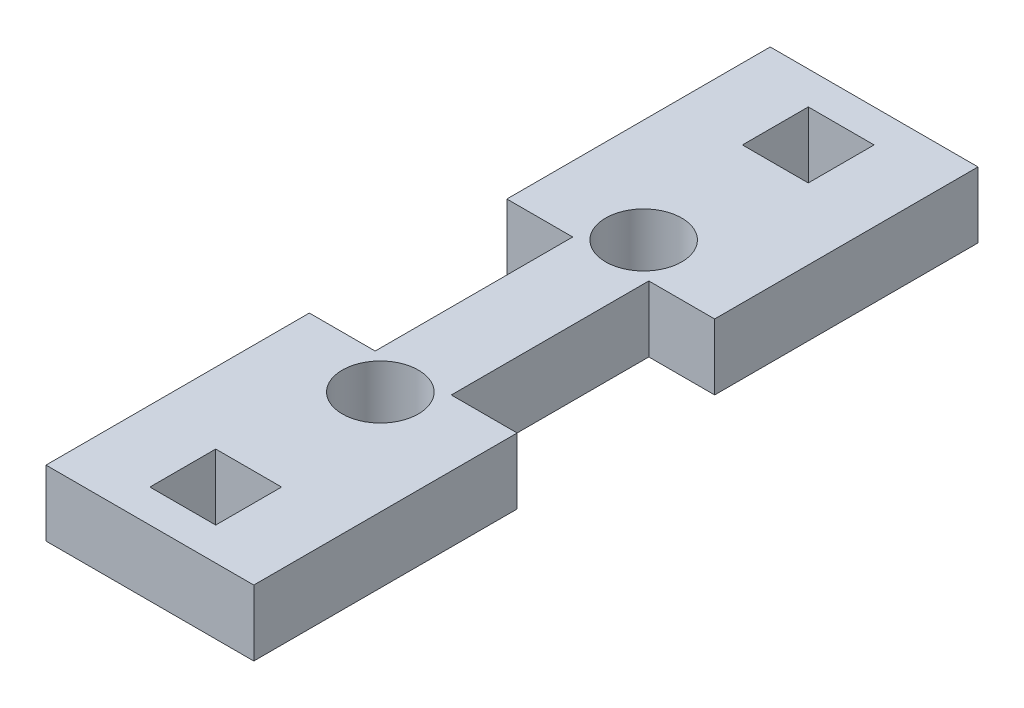
ISO-10303-21;
HEADER;
FILE_DESCRIPTION(('STEP AP214'),'2;1');
FILE_NAME('part.step','',(''),(''),'','','');
FILE_SCHEMA(('AUTOMOTIVE_DESIGN { 1 0 10303 214 1 1 1 1 }'));
ENDSEC;
DATA;
#1=APPLICATION_CONTEXT('core data for automotive mechanical design processes');
#2=APPLICATION_PROTOCOL_DEFINITION('international standard','automotive_design',2000,#1);
#3=PRODUCT_CONTEXT('',#1,'mechanical');
#4=PRODUCT('Part','Part','',(#3));
#5=PRODUCT_RELATED_PRODUCT_CATEGORY('part','',(#4));
#6=PRODUCT_DEFINITION_FORMATION('','',#4);
#7=PRODUCT_DEFINITION_CONTEXT('part definition',#1,'design');
#8=PRODUCT_DEFINITION('design','',#6,#7);
#9=PRODUCT_DEFINITION_SHAPE('','',#8);
#10=(LENGTH_UNIT() NAMED_UNIT(*) SI_UNIT(.MILLI.,.METRE.));
#11=(NAMED_UNIT(*) PLANE_ANGLE_UNIT() SI_UNIT($,.RADIAN.));
#12=(NAMED_UNIT(*) SI_UNIT($,.STERADIAN.) SOLID_ANGLE_UNIT());
#13=UNCERTAINTY_MEASURE_WITH_UNIT(LENGTH_MEASURE(1.E-05),#10,'distance_accuracy_value','');
#14=(GEOMETRIC_REPRESENTATION_CONTEXT(3) GLOBAL_UNCERTAINTY_ASSIGNED_CONTEXT((#13)) GLOBAL_UNIT_ASSIGNED_CONTEXT((#10,
#11,#12)) REPRESENTATION_CONTEXT('',''));
#15=CARTESIAN_POINT('',(0.,0.,0.));
#16=DIRECTION('',(0.,0.,1.));
#17=DIRECTION('',(1.,0.,0.));
#18=AXIS2_PLACEMENT_3D('',#15,#16,#17);
#19=CARTESIAN_POINT('',(0.,6.35,-44.45));
#20=DIRECTION('',(0.,0.,-1.));
#21=DIRECTION('',(-1.,0.,0.));
#22=AXIS2_PLACEMENT_3D('',#19,#20,#21);
#23=PLANE('',#22);
#24=DIRECTION('',(1.,0.,0.));
#25=VECTOR('',#24,1.);
#26=CARTESIAN_POINT('',(0.,0.,-44.45));
#27=LINE('',#26,#25);
#28=CARTESIAN_POINT('',(0.,0.,-44.45));
#29=VERTEX_POINT('',#28);
#30=CARTESIAN_POINT('',(6.35,0.,-44.45));
#31=VERTEX_POINT('',#30);
#32=EDGE_CURVE('E244',#29,#31,#27,.T.);
#33=ORIENTED_EDGE('',*,*,#32,.T.);
#34=DIRECTION('',(0.,-1.,0.));
#35=VECTOR('',#34,1.);
#36=CARTESIAN_POINT('',(6.35,6.35,-44.45));
#37=LINE('',#36,#35);
#38=CARTESIAN_POINT('',(6.35,6.35,-44.45));
#39=VERTEX_POINT('',#38);
#40=EDGE_CURVE('E11',#39,#31,#37,.T.);
#41=ORIENTED_EDGE('',*,*,#40,.F.);
#42=DIRECTION('',(1.,0.,0.));
#43=VECTOR('',#42,1.);
#44=CARTESIAN_POINT('',(0.,6.35,-44.45));
#45=LINE('',#44,#43);
#46=CARTESIAN_POINT('',(0.,6.35,-44.45));
#47=VERTEX_POINT('',#46);
#48=EDGE_CURVE('E512',#47,#39,#45,.T.);
#49=ORIENTED_EDGE('',*,*,#48,.F.);
#50=DIRECTION('',(0.,-1.,0.));
#51=VECTOR('',#50,1.);
#52=CARTESIAN_POINT('',(0.,6.35,-44.45));
#53=LINE('',#52,#51);
#54=EDGE_CURVE('E54',#47,#29,#53,.T.);
#55=ORIENTED_EDGE('',*,*,#54,.T.);
#56=EDGE_LOOP('',(#33,#41,#49,#55));
#57=FACE_BOUND('',#56,.T.);
#58=ADVANCED_FACE('F35',(#57),#23,.F.);
#59=CARTESIAN_POINT('',(6.35000000000002,6.35,0.));
#60=DIRECTION('',(1.,0.,0.));
#61=DIRECTION('',(0.,0.,-1.));
#62=AXIS2_PLACEMENT_3D('',#59,#60,#61);
#63=PLANE('',#62);
#64=DIRECTION('',(0.,0.,1.));
#65=VECTOR('',#64,1.);
#66=CARTESIAN_POINT('',(6.35000000000002,0.,0.));
#67=LINE('',#66,#65);
#68=CARTESIAN_POINT('',(6.35,0.,-25.4));
#69=VERTEX_POINT('',#68);
#70=EDGE_CURVE('E246',#31,#69,#67,.T.);
#71=ORIENTED_EDGE('',*,*,#70,.T.);
#72=DIRECTION('',(0.,-1.,0.));
#73=VECTOR('',#72,1.);
#74=CARTESIAN_POINT('',(6.35,6.35,-25.4));
#75=LINE('',#74,#73);
#76=CARTESIAN_POINT('',(6.35,6.35,-25.4));
#77=VERTEX_POINT('',#76);
#78=EDGE_CURVE('E45',#77,#69,#75,.T.);
#79=ORIENTED_EDGE('',*,*,#78,.F.);
#80=DIRECTION('',(0.,0.,1.));
#81=VECTOR('',#80,1.);
#82=CARTESIAN_POINT('',(6.35000000000002,6.35,0.));
#83=LINE('',#82,#81);
#84=EDGE_CURVE('E473',#39,#77,#83,.T.);
#85=ORIENTED_EDGE('',*,*,#84,.F.);
#86=ORIENTED_EDGE('',*,*,#40,.T.);
#87=EDGE_LOOP('',(#71,#79,#85,#86));
#88=FACE_BOUND('',#87,.T.);
#89=ADVANCED_FACE('F332',(#88),#63,.F.);
#90=CARTESIAN_POINT('',(0.,6.35,-25.4));
#91=DIRECTION('',(0.,0.,-1.));
#92=DIRECTION('',(-1.,0.,0.));
#93=AXIS2_PLACEMENT_3D('',#90,#91,#92);
#94=PLANE('',#93);
#95=DIRECTION('',(1.,0.,0.));
#96=VECTOR('',#95,1.);
#97=CARTESIAN_POINT('',(0.,0.,-25.4));
#98=LINE('',#97,#96);
#99=CARTESIAN_POINT('',(0.,0.,-25.4));
#100=VERTEX_POINT('',#99);
#101=EDGE_CURVE('E249',#100,#69,#98,.T.);
#102=ORIENTED_EDGE('',*,*,#101,.F.);
#103=DIRECTION('',(0.,-1.,0.));
#104=VECTOR('',#103,1.);
#105=CARTESIAN_POINT('',(0.,6.35,-25.4));
#106=LINE('',#105,#104);
#107=CARTESIAN_POINT('',(0.,6.35,-25.4));
#108=VERTEX_POINT('',#107);
#109=EDGE_CURVE('E286',#108,#100,#106,.T.);
#110=ORIENTED_EDGE('',*,*,#109,.F.);
#111=DIRECTION('',(1.,0.,0.));
#112=VECTOR('',#111,1.);
#113=CARTESIAN_POINT('',(0.,6.35,-25.4));
#114=LINE('',#113,#112);
#115=EDGE_CURVE('E471',#108,#77,#114,.T.);
#116=ORIENTED_EDGE('',*,*,#115,.T.);
#117=ORIENTED_EDGE('',*,*,#78,.T.);
#118=EDGE_LOOP('',(#102,#110,#116,#117));
#119=FACE_BOUND('',#118,.T.);
#120=ADVANCED_FACE('F337',(#119),#94,.T.);
#121=CARTESIAN_POINT('',(0.,6.35,0.));
#122=DIRECTION('',(-1.,0.,0.));
#123=DIRECTION('',(0.,0.,1.));
#124=AXIS2_PLACEMENT_3D('',#121,#122,#123);
#125=PLANE('',#124);
#126=DIRECTION('',(0.,0.,-1.));
#127=VECTOR('',#126,1.);
#128=CARTESIAN_POINT('',(0.,0.,0.));
#129=LINE('',#128,#127);
#130=CARTESIAN_POINT('',(0.,0.,0.));
#131=VERTEX_POINT('',#130);
#132=EDGE_CURVE('E252',#131,#100,#129,.T.);
#133=ORIENTED_EDGE('',*,*,#132,.F.);
#134=DIRECTION('',(0.,-1.,0.));
#135=VECTOR('',#134,1.);
#136=CARTESIAN_POINT('',(0.,6.35,0.));
#137=LINE('',#136,#135);
#138=CARTESIAN_POINT('',(0.,6.35,0.));
#139=VERTEX_POINT('',#138);
#140=EDGE_CURVE('E284',#139,#131,#137,.T.);
#141=ORIENTED_EDGE('',*,*,#140,.F.);
#142=DIRECTION('',(0.,0.,-1.));
#143=VECTOR('',#142,1.);
#144=CARTESIAN_POINT('',(0.,6.35,0.));
#145=LINE('',#144,#143);
#146=EDGE_CURVE('E210',#139,#108,#145,.T.);
#147=ORIENTED_EDGE('',*,*,#146,.T.);
#148=ORIENTED_EDGE('',*,*,#109,.T.);
#149=EDGE_LOOP('',(#133,#141,#147,#148));
#150=FACE_BOUND('',#149,.T.);
#151=ADVANCED_FACE('F410',(#150),#125,.T.);
#152=CARTESIAN_POINT('',(0.,6.35,0.));
#153=DIRECTION('',(0.,0.,-1.));
#154=DIRECTION('',(-1.,0.,0.));
#155=AXIS2_PLACEMENT_3D('',#152,#153,#154);
#156=PLANE('',#155);
#157=DIRECTION('',(1.,0.,0.));
#158=VECTOR('',#157,1.);
#159=CARTESIAN_POINT('',(0.,0.,0.));
#160=LINE('',#159,#158);
#161=CARTESIAN_POINT('',(20.0405999999999,0.,0.));
#162=VERTEX_POINT('',#161);
#163=EDGE_CURVE('E255',#131,#162,#160,.T.);
#164=ORIENTED_EDGE('',*,*,#163,.T.);
#165=DIRECTION('',(0.,-1.,0.));
#166=VECTOR('',#165,1.);
#167=CARTESIAN_POINT('',(20.0405999999999,6.35,0.));
#168=LINE('',#167,#166);
#169=CARTESIAN_POINT('',(20.0405999999999,6.35,0.));
#170=VERTEX_POINT('',#169);
#171=EDGE_CURVE('E281',#170,#162,#168,.T.);
#172=ORIENTED_EDGE('',*,*,#171,.F.);
#173=DIRECTION('',(1.,0.,0.));
#174=VECTOR('',#173,1.);
#175=CARTESIAN_POINT('',(0.,6.35,0.));
#176=LINE('',#175,#174);
#177=EDGE_CURVE('E470',#139,#170,#176,.T.);
#178=ORIENTED_EDGE('',*,*,#177,.F.);
#179=ORIENTED_EDGE('',*,*,#140,.T.);
#180=EDGE_LOOP('',(#164,#172,#178,#179));
#181=FACE_BOUND('',#180,.T.);
#182=ADVANCED_FACE('F450',(#181),#156,.F.);
#183=CARTESIAN_POINT('',(20.0405999999999,6.35,0.));
#184=DIRECTION('',(-1.,0.,0.));
#185=DIRECTION('',(0.,0.,1.));
#186=AXIS2_PLACEMENT_3D('',#183,#184,#185);
#187=PLANE('',#186);
#188=DIRECTION('',(0.,0.,-1.));
#189=VECTOR('',#188,1.);
#190=CARTESIAN_POINT('',(20.0405999999999,0.,0.));
#191=LINE('',#190,#189);
#192=CARTESIAN_POINT('',(20.0405999999999,0.,-25.4));
#193=VERTEX_POINT('',#192);
#194=EDGE_CURVE('E258',#162,#193,#191,.T.);
#195=ORIENTED_EDGE('',*,*,#194,.T.);
#196=DIRECTION('',(0.,-1.,0.));
#197=VECTOR('',#196,1.);
#198=CARTESIAN_POINT('',(20.0405999999999,6.35,-25.4));
#199=LINE('',#198,#197);
#200=CARTESIAN_POINT('',(20.0405999999999,6.35,-25.4));
#201=VERTEX_POINT('',#200);
#202=EDGE_CURVE('E279',#201,#193,#199,.T.);
#203=ORIENTED_EDGE('',*,*,#202,.F.);
#204=DIRECTION('',(0.,0.,-1.));
#205=VECTOR('',#204,1.);
#206=CARTESIAN_POINT('',(20.0405999999999,6.35,0.));
#207=LINE('',#206,#205);
#208=EDGE_CURVE('E195',#170,#201,#207,.T.);
#209=ORIENTED_EDGE('',*,*,#208,.F.);
#210=ORIENTED_EDGE('',*,*,#171,.T.);
#211=EDGE_LOOP('',(#195,#203,#209,#210));
#212=FACE_BOUND('',#211,.T.);
#213=ADVANCED_FACE('F438',(#212),#187,.F.);
#214=CARTESIAN_POINT('',(0.,6.35,-25.4));
#215=DIRECTION('',(0.,0.,-1.));
#216=DIRECTION('',(-1.,0.,0.));
#217=AXIS2_PLACEMENT_3D('',#214,#215,#216);
#218=PLANE('',#217);
#219=DIRECTION('',(1.,0.,0.));
#220=VECTOR('',#219,1.);
#221=CARTESIAN_POINT('',(0.,0.,-25.4));
#222=LINE('',#221,#220);
#223=CARTESIAN_POINT('',(13.6905999999999,0.,-25.4));
#224=VERTEX_POINT('',#223);
#225=EDGE_CURVE('E261',#224,#193,#222,.T.);
#226=ORIENTED_EDGE('',*,*,#225,.F.);
#227=DIRECTION('',(0.,-1.,0.));
#228=VECTOR('',#227,1.);
#229=CARTESIAN_POINT('',(13.6905999999999,6.35,-25.4));
#230=LINE('',#229,#228);
#231=CARTESIAN_POINT('',(13.6905999999999,6.35,-25.4));
#232=VERTEX_POINT('',#231);
#233=EDGE_CURVE('E277',#232,#224,#230,.T.);
#234=ORIENTED_EDGE('',*,*,#233,.F.);
#235=DIRECTION('',(1.,0.,0.));
#236=VECTOR('',#235,1.);
#237=CARTESIAN_POINT('',(0.,6.35,-25.4));
#238=LINE('',#237,#236);
#239=EDGE_CURVE('E477',#232,#201,#238,.T.);
#240=ORIENTED_EDGE('',*,*,#239,.T.);
#241=ORIENTED_EDGE('',*,*,#202,.T.);
#242=EDGE_LOOP('',(#226,#234,#240,#241));
#243=FACE_BOUND('',#242,.T.);
#244=ADVANCED_FACE('F445',(#243),#218,.T.);
#245=CARTESIAN_POINT('',(13.6905999999999,6.35,0.));
#246=DIRECTION('',(1.,0.,0.));
#247=DIRECTION('',(0.,0.,-1.));
#248=AXIS2_PLACEMENT_3D('',#245,#246,#247);
#249=PLANE('',#248);
#250=DIRECTION('',(0.,0.,1.));
#251=VECTOR('',#250,1.);
#252=CARTESIAN_POINT('',(13.6905999999999,0.,0.));
#253=LINE('',#252,#251);
#254=CARTESIAN_POINT('',(13.6905999999999,0.,-44.45));
#255=VERTEX_POINT('',#254);
#256=EDGE_CURVE('E264',#255,#224,#253,.T.);
#257=ORIENTED_EDGE('',*,*,#256,.F.);
#258=DIRECTION('',(0.,-1.,0.));
#259=VECTOR('',#258,1.);
#260=CARTESIAN_POINT('',(13.6905999999999,6.35,-44.45));
#261=LINE('',#260,#259);
#262=CARTESIAN_POINT('',(13.6905999999999,6.35,-44.45));
#263=VERTEX_POINT('',#262);
#264=EDGE_CURVE('E275',#263,#255,#261,.T.);
#265=ORIENTED_EDGE('',*,*,#264,.F.);
#266=DIRECTION('',(0.,0.,1.));
#267=VECTOR('',#266,1.);
#268=CARTESIAN_POINT('',(13.6905999999999,6.35,0.));
#269=LINE('',#268,#267);
#270=EDGE_CURVE('E479',#263,#232,#269,.T.);
#271=ORIENTED_EDGE('',*,*,#270,.T.);
#272=ORIENTED_EDGE('',*,*,#233,.T.);
#273=EDGE_LOOP('',(#257,#265,#271,#272));
#274=FACE_BOUND('',#273,.T.);
#275=ADVANCED_FACE('F441',(#274),#249,.T.);
#276=CARTESIAN_POINT('',(0.,6.35,-44.45));
#277=DIRECTION('',(0.,0.,-1.));
#278=DIRECTION('',(-1.,0.,0.));
#279=AXIS2_PLACEMENT_3D('',#276,#277,#278);
#280=PLANE('',#279);
#281=DIRECTION('',(1.,0.,0.));
#282=VECTOR('',#281,1.);
#283=CARTESIAN_POINT('',(0.,0.,-44.45));
#284=LINE('',#283,#282);
#285=CARTESIAN_POINT('',(20.0405999999999,0.,-44.45));
#286=VERTEX_POINT('',#285);
#287=EDGE_CURVE('E267',#255,#286,#284,.T.);
#288=ORIENTED_EDGE('',*,*,#287,.T.);
#289=DIRECTION('',(0.,-1.,0.));
#290=VECTOR('',#289,1.);
#291=CARTESIAN_POINT('',(20.0405999999999,6.35,-44.45));
#292=LINE('',#291,#290);
#293=CARTESIAN_POINT('',(20.0405999999999,6.35,-44.45));
#294=VERTEX_POINT('',#293);
#295=EDGE_CURVE('E203',#294,#286,#292,.T.);
#296=ORIENTED_EDGE('',*,*,#295,.F.);
#297=DIRECTION('',(1.,0.,0.));
#298=VECTOR('',#297,1.);
#299=CARTESIAN_POINT('',(0.,6.35,-44.45));
#300=LINE('',#299,#298);
#301=EDGE_CURVE('E190',#263,#294,#300,.T.);
#302=ORIENTED_EDGE('',*,*,#301,.F.);
#303=ORIENTED_EDGE('',*,*,#264,.T.);
#304=EDGE_LOOP('',(#288,#296,#302,#303));
#305=FACE_BOUND('',#304,.T.);
#306=ADVANCED_FACE('F437',(#305),#280,.F.);
#307=CARTESIAN_POINT('',(20.0405999999999,0.,-69.85));
#308=VERTEX_POINT('',#307);
#309=EDGE_CURVE('E200',#286,#308,#191,.T.);
#310=ORIENTED_EDGE('',*,*,#309,.T.);
#311=DIRECTION('',(0.,-1.,0.));
#312=VECTOR('',#311,1.);
#313=CARTESIAN_POINT('',(20.0405999999999,6.35,-69.85));
#314=LINE('',#313,#312);
#315=CARTESIAN_POINT('',(20.0405999999999,6.35,-69.85));
#316=VERTEX_POINT('',#315);
#317=EDGE_CURVE('E197',#316,#308,#314,.T.);
#318=ORIENTED_EDGE('',*,*,#317,.F.);
#319=EDGE_CURVE('E181',#294,#316,#207,.T.);
#320=ORIENTED_EDGE('',*,*,#319,.F.);
#321=ORIENTED_EDGE('',*,*,#295,.T.);
#322=EDGE_LOOP('',(#310,#318,#320,#321));
#323=FACE_BOUND('',#322,.T.);
#324=ADVANCED_FACE('F198',(#323),#187,.F.);
#325=CARTESIAN_POINT('',(0.,6.35,-69.85));
#326=DIRECTION('',(0.,0.,-1.));
#327=DIRECTION('',(-1.,0.,0.));
#328=AXIS2_PLACEMENT_3D('',#325,#326,#327);
#329=PLANE('',#328);
#330=DIRECTION('',(1.,0.,0.));
#331=VECTOR('',#330,1.);
#332=CARTESIAN_POINT('',(0.,0.,-69.85));
#333=LINE('',#332,#331);
#334=CARTESIAN_POINT('',(0.,0.,-69.85));
#335=VERTEX_POINT('',#334);
#336=EDGE_CURVE('E269',#335,#308,#333,.T.);
#337=ORIENTED_EDGE('',*,*,#336,.F.);
#338=DIRECTION('',(0.,-1.,0.));
#339=VECTOR('',#338,1.);
#340=CARTESIAN_POINT('',(0.,6.35,-69.85));
#341=LINE('',#340,#339);
#342=CARTESIAN_POINT('',(0.,6.35,-69.85));
#343=VERTEX_POINT('',#342);
#344=EDGE_CURVE('E116',#343,#335,#341,.T.);
#345=ORIENTED_EDGE('',*,*,#344,.F.);
#346=DIRECTION('',(1.,0.,0.));
#347=VECTOR('',#346,1.);
#348=CARTESIAN_POINT('',(0.,6.35,-69.85));
#349=LINE('',#348,#347);
#350=EDGE_CURVE('E187',#343,#316,#349,.T.);
#351=ORIENTED_EDGE('',*,*,#350,.T.);
#352=ORIENTED_EDGE('',*,*,#317,.T.);
#353=EDGE_LOOP('',(#337,#345,#351,#352));
#354=FACE_BOUND('',#353,.T.);
#355=ADVANCED_FACE('F205',(#354),#329,.T.);
#356=CARTESIAN_POINT('',(-1.45716771982052E-13,6.35,-66.675));
#357=DIRECTION('',(0.,0.,-1.));
#358=DIRECTION('',(-1.,0.,0.));
#359=AXIS2_PLACEMENT_3D('',#356,#357,#358);
#360=PLANE('',#359);
#361=DIRECTION('',(1.,0.,0.));
#362=VECTOR('',#361,1.);
#363=CARTESIAN_POINT('',(-1.45716771982052E-13,0.,-66.675));
#364=LINE('',#363,#362);
#365=CARTESIAN_POINT('',(6.84529999999994,0.,-66.675));
#366=VERTEX_POINT('',#365);
#367=CARTESIAN_POINT('',(13.1952999999999,0.,-66.675));
#368=VERTEX_POINT('',#367);
#369=EDGE_CURVE('E232',#366,#368,#364,.T.);
#370=ORIENTED_EDGE('',*,*,#369,.T.);
#371=DIRECTION('',(0.,-1.,0.));
#372=VECTOR('',#371,1.);
#373=CARTESIAN_POINT('',(13.1952999999999,6.35,-66.675));
#374=LINE('',#373,#372);
#375=CARTESIAN_POINT('',(13.1952999999999,6.35,-66.675));
#376=VERTEX_POINT('',#375);
#377=EDGE_CURVE('E272',#376,#368,#374,.T.);
#378=ORIENTED_EDGE('',*,*,#377,.F.);
#379=DIRECTION('',(1.,0.,0.));
#380=VECTOR('',#379,1.);
#381=CARTESIAN_POINT('',(-1.45716771982052E-13,6.35,-66.675));
#382=LINE('',#381,#380);
#383=CARTESIAN_POINT('',(6.84529999999994,6.35,-66.675));
#384=VERTEX_POINT('',#383);
#385=EDGE_CURVE('E501',#384,#376,#382,.T.);
#386=ORIENTED_EDGE('',*,*,#385,.F.);
#387=DIRECTION('',(0.,-1.,0.));
#388=VECTOR('',#387,1.);
#389=CARTESIAN_POINT('',(6.84529999999994,6.35,-66.675));
#390=LINE('',#389,#388);
#391=EDGE_CURVE('E289',#384,#366,#390,.T.);
#392=ORIENTED_EDGE('',*,*,#391,.T.);
#393=EDGE_LOOP('',(#370,#378,#386,#392));
#394=FACE_BOUND('',#393,.T.);
#395=ADVANCED_FACE('F349',(#394),#360,.F.);
#396=CARTESIAN_POINT('',(13.1953,6.35,0.));
#397=DIRECTION('',(1.,0.,0.));
#398=DIRECTION('',(0.,0.,-1.));
#399=AXIS2_PLACEMENT_3D('',#396,#397,#398);
#400=PLANE('',#399);
#401=DIRECTION('',(0.,0.,1.));
#402=VECTOR('',#401,1.);
#403=CARTESIAN_POINT('',(13.1953,0.,0.));
#404=LINE('',#403,#402);
#405=CARTESIAN_POINT('',(13.1952999999999,0.,-60.325));
#406=VERTEX_POINT('',#405);
#407=EDGE_CURVE('E235',#368,#406,#404,.T.);
#408=ORIENTED_EDGE('',*,*,#407,.T.);
#409=DIRECTION('',(0.,-1.,0.));
#410=VECTOR('',#409,1.);
#411=CARTESIAN_POINT('',(13.1952999999999,6.35,-60.325));
#412=LINE('',#411,#410);
#413=CARTESIAN_POINT('',(13.1952999999999,6.35,-60.325));
#414=VERTEX_POINT('',#413);
#415=EDGE_CURVE('E293',#414,#406,#412,.T.);
#416=ORIENTED_EDGE('',*,*,#415,.F.);
#417=DIRECTION('',(0.,0.,1.));
#418=VECTOR('',#417,1.);
#419=CARTESIAN_POINT('',(13.1953,6.35,0.));
#420=LINE('',#419,#418);
#421=EDGE_CURVE('E504',#376,#414,#420,.T.);
#422=ORIENTED_EDGE('',*,*,#421,.F.);
#423=ORIENTED_EDGE('',*,*,#377,.T.);
#424=EDGE_LOOP('',(#408,#416,#422,#423));
#425=FACE_BOUND('',#424,.T.);
#426=ADVANCED_FACE('F345',(#425),#400,.F.);
#427=CARTESIAN_POINT('',(0.,6.35,-60.325));
#428=DIRECTION('',(0.,0.,-1.));
#429=DIRECTION('',(-1.,0.,0.));
#430=AXIS2_PLACEMENT_3D('',#427,#428,#429);
#431=PLANE('',#430);
#432=DIRECTION('',(1.,0.,0.));
#433=VECTOR('',#432,1.);
#434=CARTESIAN_POINT('',(0.,0.,-60.325));
#435=LINE('',#434,#433);
#436=CARTESIAN_POINT('',(6.84529999999994,0.,-60.325));
#437=VERTEX_POINT('',#436);
#438=EDGE_CURVE('E238',#437,#406,#435,.T.);
#439=ORIENTED_EDGE('',*,*,#438,.F.);
#440=DIRECTION('',(0.,-1.,0.));
#441=VECTOR('',#440,1.);
#442=CARTESIAN_POINT('',(6.84529999999994,6.35,-60.325));
#443=LINE('',#442,#441);
#444=CARTESIAN_POINT('',(6.84529999999994,6.35,-60.325));
#445=VERTEX_POINT('',#444);
#446=EDGE_CURVE('E291',#445,#437,#443,.T.);
#447=ORIENTED_EDGE('',*,*,#446,.F.);
#448=DIRECTION('',(1.,0.,0.));
#449=VECTOR('',#448,1.);
#450=CARTESIAN_POINT('',(0.,6.35,-60.325));
#451=LINE('',#450,#449);
#452=EDGE_CURVE('E506',#445,#414,#451,.T.);
#453=ORIENTED_EDGE('',*,*,#452,.T.);
#454=ORIENTED_EDGE('',*,*,#415,.T.);
#455=EDGE_LOOP('',(#439,#447,#453,#454));
#456=FACE_BOUND('',#455,.T.);
#457=ADVANCED_FACE('F342',(#456),#431,.T.);
#458=CARTESIAN_POINT('',(0.,6.35,-3.17499999999999));
#459=DIRECTION('',(0.,0.,1.));
#460=DIRECTION('',(1.,0.,0.));
#461=AXIS2_PLACEMENT_3D('',#458,#459,#460);
#462=PLANE('',#461);
#463=DIRECTION('',(-1.,0.,0.));
#464=VECTOR('',#463,1.);
#465=CARTESIAN_POINT('',(0.,0.,-3.17499999999999));
#466=LINE('',#465,#464);
#467=CARTESIAN_POINT('',(13.1952999999999,0.,-3.17499999999999));
#468=VERTEX_POINT('',#467);
#469=CARTESIAN_POINT('',(6.84529999999995,0.,-3.17499999999999));
#470=VERTEX_POINT('',#469);
#471=EDGE_CURVE('E220',#468,#470,#466,.T.);
#472=ORIENTED_EDGE('',*,*,#471,.T.);
#473=DIRECTION('',(0.,-1.,0.));
#474=VECTOR('',#473,1.);
#475=CARTESIAN_POINT('',(6.84529999999995,6.35,-3.17499999999999));
#476=LINE('',#475,#474);
#477=CARTESIAN_POINT('',(6.84529999999995,6.35,-3.17499999999999));
#478=VERTEX_POINT('',#477);
#479=EDGE_CURVE('E39',#478,#470,#476,.T.);
#480=ORIENTED_EDGE('',*,*,#479,.F.);
#481=DIRECTION('',(-1.,0.,0.));
#482=VECTOR('',#481,1.);
#483=CARTESIAN_POINT('',(0.,6.35,-3.17499999999999));
#484=LINE('',#483,#482);
#485=CARTESIAN_POINT('',(13.1952999999999,6.35,-3.17499999999999));
#486=VERTEX_POINT('',#485);
#487=EDGE_CURVE('E493',#486,#478,#484,.T.);
#488=ORIENTED_EDGE('',*,*,#487,.F.);
#489=DIRECTION('',(0.,-1.,0.));
#490=VECTOR('',#489,1.);
#491=CARTESIAN_POINT('',(13.1952999999999,6.35,-3.17499999999999));
#492=LINE('',#491,#490);
#493=EDGE_CURVE('E208',#486,#468,#492,.T.);
#494=ORIENTED_EDGE('',*,*,#493,.T.);
#495=EDGE_LOOP('',(#472,#480,#488,#494));
#496=FACE_BOUND('',#495,.T.);
#497=ADVANCED_FACE('F308',(#496),#462,.F.);
#498=CARTESIAN_POINT('',(6.84529999999995,6.35,0.));
#499=DIRECTION('',(-1.,0.,0.));
#500=DIRECTION('',(0.,0.,1.));
#501=AXIS2_PLACEMENT_3D('',#498,#499,#500);
#502=PLANE('',#501);
#503=DIRECTION('',(0.,0.,-1.));
#504=VECTOR('',#503,1.);
#505=CARTESIAN_POINT('',(6.84529999999995,0.,0.));
#506=LINE('',#505,#504);
#507=CARTESIAN_POINT('',(6.84529999999995,0.,-9.525));
#508=VERTEX_POINT('',#507);
#509=EDGE_CURVE('E223',#470,#508,#506,.T.);
#510=ORIENTED_EDGE('',*,*,#509,.T.);
#511=DIRECTION('',(0.,-1.,0.));
#512=VECTOR('',#511,1.);
#513=CARTESIAN_POINT('',(6.84529999999995,6.35,-9.525));
#514=LINE('',#513,#512);
#515=CARTESIAN_POINT('',(6.84529999999995,6.35,-9.525));
#516=VERTEX_POINT('',#515);
#517=EDGE_CURVE('E299',#516,#508,#514,.T.);
#518=ORIENTED_EDGE('',*,*,#517,.F.);
#519=DIRECTION('',(0.,0.,-1.));
#520=VECTOR('',#519,1.);
#521=CARTESIAN_POINT('',(6.84529999999995,6.35,0.));
#522=LINE('',#521,#520);
#523=EDGE_CURVE('E129',#478,#516,#522,.T.);
#524=ORIENTED_EDGE('',*,*,#523,.F.);
#525=ORIENTED_EDGE('',*,*,#479,.T.);
#526=EDGE_LOOP('',(#510,#518,#524,#525));
#527=FACE_BOUND('',#526,.T.);
#528=ADVANCED_FACE('F304',(#527),#502,.F.);
#529=CARTESIAN_POINT('',(0.,6.35,-9.525));
#530=DIRECTION('',(0.,0.,1.));
#531=DIRECTION('',(1.,0.,0.));
#532=AXIS2_PLACEMENT_3D('',#529,#530,#531);
#533=PLANE('',#532);
#534=DIRECTION('',(-1.,0.,0.));
#535=VECTOR('',#534,1.);
#536=CARTESIAN_POINT('',(0.,0.,-9.525));
#537=LINE('',#536,#535);
#538=CARTESIAN_POINT('',(13.1952999999999,0.,-9.525));
#539=VERTEX_POINT('',#538);
#540=EDGE_CURVE('E226',#539,#508,#537,.T.);
#541=ORIENTED_EDGE('',*,*,#540,.F.);
#542=DIRECTION('',(0.,-1.,0.));
#543=VECTOR('',#542,1.);
#544=CARTESIAN_POINT('',(13.1952999999999,6.35,-9.525));
#545=LINE('',#544,#543);
#546=CARTESIAN_POINT('',(13.1952999999999,6.35,-9.525));
#547=VERTEX_POINT('',#546);
#548=EDGE_CURVE('E298',#547,#539,#545,.T.);
#549=ORIENTED_EDGE('',*,*,#548,.F.);
#550=DIRECTION('',(-1.,0.,0.));
#551=VECTOR('',#550,1.);
#552=CARTESIAN_POINT('',(0.,6.35,-9.525));
#553=LINE('',#552,#551);
#554=EDGE_CURVE('E498',#547,#516,#553,.T.);
#555=ORIENTED_EDGE('',*,*,#554,.T.);
#556=ORIENTED_EDGE('',*,*,#517,.T.);
#557=EDGE_LOOP('',(#541,#549,#555,#556));
#558=FACE_BOUND('',#557,.T.);
#559=ADVANCED_FACE('F319',(#558),#533,.T.);
#560=CARTESIAN_POINT('',(6.84530000000001,6.35,0.));
#561=DIRECTION('',(1.,0.,0.));
#562=DIRECTION('',(0.,0.,-1.));
#563=AXIS2_PLACEMENT_3D('',#560,#561,#562);
#564=PLANE('',#563);
#565=DIRECTION('',(0.,0.,1.));
#566=VECTOR('',#565,1.);
#567=CARTESIAN_POINT('',(6.84530000000001,0.,0.));
#568=LINE('',#567,#566);
#569=EDGE_CURVE('E241',#366,#437,#568,.T.);
#570=ORIENTED_EDGE('',*,*,#569,.F.);
#571=ORIENTED_EDGE('',*,*,#391,.F.);
#572=DIRECTION('',(0.,0.,1.));
#573=VECTOR('',#572,1.);
#574=CARTESIAN_POINT('',(6.84530000000001,6.35,0.));
#575=LINE('',#574,#573);
#576=EDGE_CURVE('E509',#384,#445,#575,.T.);
#577=ORIENTED_EDGE('',*,*,#576,.T.);
#578=ORIENTED_EDGE('',*,*,#446,.T.);
#579=EDGE_LOOP('',(#570,#571,#577,#578));
#580=FACE_BOUND('',#579,.T.);
#581=ADVANCED_FACE('F321',(#580),#564,.T.);
#582=CARTESIAN_POINT('',(13.1952999999999,6.35,0.));
#583=DIRECTION('',(-1.,0.,0.));
#584=DIRECTION('',(0.,0.,1.));
#585=AXIS2_PLACEMENT_3D('',#582,#583,#584);
#586=PLANE('',#585);
#587=DIRECTION('',(0.,0.,-1.));
#588=VECTOR('',#587,1.);
#589=CARTESIAN_POINT('',(13.1952999999999,0.,0.));
#590=LINE('',#589,#588);
#591=EDGE_CURVE('E229',#468,#539,#590,.T.);
#592=ORIENTED_EDGE('',*,*,#591,.F.);
#593=ORIENTED_EDGE('',*,*,#493,.F.);
#594=DIRECTION('',(0.,0.,-1.));
#595=VECTOR('',#594,1.);
#596=CARTESIAN_POINT('',(13.1952999999999,6.35,0.));
#597=LINE('',#596,#595);
#598=EDGE_CURVE('E317',#486,#547,#597,.T.);
#599=ORIENTED_EDGE('',*,*,#598,.T.);
#600=ORIENTED_EDGE('',*,*,#548,.T.);
#601=EDGE_LOOP('',(#592,#593,#599,#600));
#602=FACE_BOUND('',#601,.T.);
#603=ADVANCED_FACE('F314',(#602),#586,.T.);
#604=CARTESIAN_POINT('',(10.0202999999999,6.35,-47.625));
#605=DIRECTION('',(0.,-1.,0.));
#606=DIRECTION('',(0.,0.,-1.));
#607=AXIS2_PLACEMENT_3D('',#604,#605,#606);
#608=CYLINDRICAL_SURFACE('',#607,3.6703);
#609=CARTESIAN_POINT('',(10.0202999999999,6.35,-47.625));
#610=DIRECTION('',(0.,1.,0.));
#611=DIRECTION('',(0.,0.,1.));
#612=AXIS2_PLACEMENT_3D('',#609,#610,#611);
#613=CIRCLE('',#612,3.6703);
#614=CARTESIAN_POINT('',(10.0202999999999,6.35,-43.9547));
#615=VERTEX_POINT('',#614);
#616=EDGE_CURVE('E490',#615,#615,#613,.T.);
#617=ORIENTED_EDGE('',*,*,#616,.T.);
#618=EDGE_LOOP('',(#617));
#619=FACE_BOUND('',#618,.T.);
#620=CARTESIAN_POINT('',(10.0202999999999,0.,-47.625));
#621=DIRECTION('',(0.,1.,0.));
#622=DIRECTION('',(0.,0.,1.));
#623=AXIS2_PLACEMENT_3D('',#620,#621,#622);
#624=CIRCLE('',#623,3.6703);
#625=CARTESIAN_POINT('',(10.0202999999999,0.,-43.9547));
#626=VERTEX_POINT('',#625);
#627=EDGE_CURVE('E217',#626,#626,#624,.T.);
#628=ORIENTED_EDGE('',*,*,#627,.F.);
#629=EDGE_LOOP('',(#628));
#630=FACE_BOUND('',#629,.T.);
#631=ADVANCED_FACE('F354',(#619,#630),#608,.F.);
#632=CARTESIAN_POINT('',(10.0202999999999,6.35,-22.225));
#633=DIRECTION('',(0.,-1.,0.));
#634=DIRECTION('',(0.,0.,-1.));
#635=AXIS2_PLACEMENT_3D('',#632,#633,#634);
#636=CYLINDRICAL_SURFACE('',#635,3.6703);
#637=CARTESIAN_POINT('',(10.0202999999999,6.35,-22.225));
#638=DIRECTION('',(0.,1.,0.));
#639=DIRECTION('',(0.,0.,1.));
#640=AXIS2_PLACEMENT_3D('',#637,#638,#639);
#641=CIRCLE('',#640,3.6703);
#642=CARTESIAN_POINT('',(10.0202999999999,6.35,-18.5547));
#643=VERTEX_POINT('',#642);
#644=EDGE_CURVE('E488',#643,#643,#641,.T.);
#645=ORIENTED_EDGE('',*,*,#644,.T.);
#646=EDGE_LOOP('',(#645));
#647=FACE_BOUND('',#646,.T.);
#648=CARTESIAN_POINT('',(10.0202999999999,0.,-22.225));
#649=DIRECTION('',(0.,1.,0.));
#650=DIRECTION('',(0.,0.,1.));
#651=AXIS2_PLACEMENT_3D('',#648,#649,#650);
#652=CIRCLE('',#651,3.6703);
#653=CARTESIAN_POINT('',(10.0202999999999,0.,-18.5547));
#654=VERTEX_POINT('',#653);
#655=EDGE_CURVE('E214',#654,#654,#652,.T.);
#656=ORIENTED_EDGE('',*,*,#655,.F.);
#657=EDGE_LOOP('',(#656));
#658=FACE_BOUND('',#657,.T.);
#659=ADVANCED_FACE('F37',(#647,#658),#636,.F.);
#660=EDGE_CURVE('E256',#29,#335,#129,.T.);
#661=ORIENTED_EDGE('',*,*,#660,.F.);
#662=ORIENTED_EDGE('',*,*,#54,.F.);
#663=EDGE_CURVE('E206',#47,#343,#145,.T.);
#664=ORIENTED_EDGE('',*,*,#663,.T.);
#665=ORIENTED_EDGE('',*,*,#344,.T.);
#666=EDGE_LOOP('',(#661,#662,#664,#665));
#667=FACE_BOUND('',#666,.T.);
#668=ADVANCED_FACE('F362',(#667),#125,.T.);
#669=CARTESIAN_POINT('',(0.,6.35,0.));
#670=DIRECTION('',(0.,1.,0.));
#671=DIRECTION('',(0.,0.,1.));
#672=AXIS2_PLACEMENT_3D('',#669,#670,#671);
#673=PLANE('',#672);
#674=ORIENTED_EDGE('',*,*,#644,.F.);
#675=EDGE_LOOP('',(#674));
#676=FACE_BOUND('',#675,.T.);
#677=ORIENTED_EDGE('',*,*,#616,.F.);
#678=EDGE_LOOP('',(#677));
#679=FACE_BOUND('',#678,.T.);
#680=ORIENTED_EDGE('',*,*,#487,.T.);
#681=ORIENTED_EDGE('',*,*,#523,.T.);
#682=ORIENTED_EDGE('',*,*,#554,.F.);
#683=ORIENTED_EDGE('',*,*,#598,.F.);
#684=EDGE_LOOP('',(#680,#681,#682,#683));
#685=FACE_BOUND('',#684,.T.);
#686=ORIENTED_EDGE('',*,*,#385,.T.);
#687=ORIENTED_EDGE('',*,*,#421,.T.);
#688=ORIENTED_EDGE('',*,*,#452,.F.);
#689=ORIENTED_EDGE('',*,*,#576,.F.);
#690=EDGE_LOOP('',(#686,#687,#688,#689));
#691=FACE_BOUND('',#690,.T.);
#692=ORIENTED_EDGE('',*,*,#48,.T.);
#693=ORIENTED_EDGE('',*,*,#84,.T.);
#694=ORIENTED_EDGE('',*,*,#115,.F.);
#695=ORIENTED_EDGE('',*,*,#146,.F.);
#696=ORIENTED_EDGE('',*,*,#177,.T.);
#697=ORIENTED_EDGE('',*,*,#208,.T.);
#698=ORIENTED_EDGE('',*,*,#239,.F.);
#699=ORIENTED_EDGE('',*,*,#270,.F.);
#700=ORIENTED_EDGE('',*,*,#301,.T.);
#701=ORIENTED_EDGE('',*,*,#319,.T.);
#702=ORIENTED_EDGE('',*,*,#350,.F.);
#703=ORIENTED_EDGE('',*,*,#663,.F.);
#704=EDGE_LOOP('',(#692,#693,#694,#695,#696,#697,#698,#699,#700,#701,#702,#703));
#705=FACE_BOUND('',#704,.T.);
#706=ADVANCED_FACE('F184',(#676,#679,#685,#691,#705),#673,.T.);
#707=CARTESIAN_POINT('',(0.,0.,0.));
#708=DIRECTION('',(0.,1.,0.));
#709=DIRECTION('',(0.,0.,1.));
#710=AXIS2_PLACEMENT_3D('',#707,#708,#709);
#711=PLANE('',#710);
#712=ORIENTED_EDGE('',*,*,#655,.T.);
#713=EDGE_LOOP('',(#712));
#714=FACE_BOUND('',#713,.T.);
#715=ORIENTED_EDGE('',*,*,#627,.T.);
#716=EDGE_LOOP('',(#715));
#717=FACE_BOUND('',#716,.T.);
#718=ORIENTED_EDGE('',*,*,#471,.F.);
#719=ORIENTED_EDGE('',*,*,#591,.T.);
#720=ORIENTED_EDGE('',*,*,#540,.T.);
#721=ORIENTED_EDGE('',*,*,#509,.F.);
#722=EDGE_LOOP('',(#718,#719,#720,#721));
#723=FACE_BOUND('',#722,.T.);
#724=ORIENTED_EDGE('',*,*,#369,.F.);
#725=ORIENTED_EDGE('',*,*,#569,.T.);
#726=ORIENTED_EDGE('',*,*,#438,.T.);
#727=ORIENTED_EDGE('',*,*,#407,.F.);
#728=EDGE_LOOP('',(#724,#725,#726,#727));
#729=FACE_BOUND('',#728,.T.);
#730=ORIENTED_EDGE('',*,*,#32,.F.);
#731=ORIENTED_EDGE('',*,*,#660,.T.);
#732=ORIENTED_EDGE('',*,*,#336,.T.);
#733=ORIENTED_EDGE('',*,*,#309,.F.);
#734=ORIENTED_EDGE('',*,*,#287,.F.);
#735=ORIENTED_EDGE('',*,*,#256,.T.);
#736=ORIENTED_EDGE('',*,*,#225,.T.);
#737=ORIENTED_EDGE('',*,*,#194,.F.);
#738=ORIENTED_EDGE('',*,*,#163,.F.);
#739=ORIENTED_EDGE('',*,*,#132,.T.);
#740=ORIENTED_EDGE('',*,*,#101,.T.);
#741=ORIENTED_EDGE('',*,*,#70,.F.);
#742=EDGE_LOOP('',(#730,#731,#732,#733,#734,#735,#736,#737,#738,#739,#740,#741));
#743=FACE_BOUND('',#742,.T.);
#744=ADVANCED_FACE('F311',(#714,#717,#723,#729,#743),#711,.F.);
#745=CLOSED_SHELL('',(#58,#89,#120,#151,#182,#213,#244,#275,#306,#324,#355,#395,#426,#457,#497,
#528,#559,#581,#603,#631,#659,#668,#706,#744));
#746=MANIFOLD_SOLID_BREP('B2',#745);
#747=ADVANCED_BREP_SHAPE_REPRESENTATION('',(#18,#746),#14);
#748=SHAPE_DEFINITION_REPRESENTATION(#9,#747);
ENDSEC;
END-ISO-10303-21;
